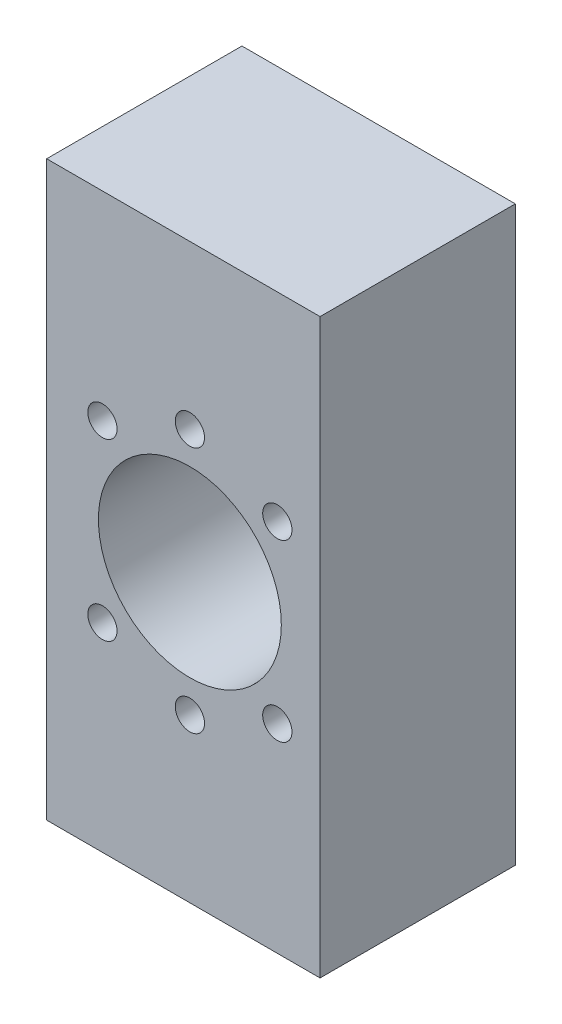
ISO-10303-21;
HEADER;
FILE_DESCRIPTION(('STEP AP214'),'2;1');
FILE_NAME('part.step','',(''),(''),'','','');
FILE_SCHEMA(('AUTOMOTIVE_DESIGN { 1 0 10303 214 1 1 1 1 }'));
ENDSEC;
DATA;
#1=APPLICATION_CONTEXT('core data for automotive mechanical design processes');
#2=APPLICATION_PROTOCOL_DEFINITION('international standard','automotive_design',2000,#1);
#3=PRODUCT_CONTEXT('',#1,'mechanical');
#4=PRODUCT('Part','Part','',(#3));
#5=PRODUCT_RELATED_PRODUCT_CATEGORY('part','',(#4));
#6=PRODUCT_DEFINITION_FORMATION('','',#4);
#7=PRODUCT_DEFINITION_CONTEXT('part definition',#1,'design');
#8=PRODUCT_DEFINITION('design','',#6,#7);
#9=PRODUCT_DEFINITION_SHAPE('','',#8);
#10=(LENGTH_UNIT() NAMED_UNIT(*) SI_UNIT(.MILLI.,.METRE.));
#11=(NAMED_UNIT(*) PLANE_ANGLE_UNIT() SI_UNIT($,.RADIAN.));
#12=(NAMED_UNIT(*) SI_UNIT($,.STERADIAN.) SOLID_ANGLE_UNIT());
#13=UNCERTAINTY_MEASURE_WITH_UNIT(LENGTH_MEASURE(1.E-05),#10,'distance_accuracy_value','');
#14=(GEOMETRIC_REPRESENTATION_CONTEXT(3) GLOBAL_UNCERTAINTY_ASSIGNED_CONTEXT((#13)) GLOBAL_UNIT_ASSIGNED_CONTEXT((#10,
#11,#12)) REPRESENTATION_CONTEXT('',''));
#15=CARTESIAN_POINT('',(0.,0.,0.));
#16=DIRECTION('',(0.,0.,1.));
#17=DIRECTION('',(1.,0.,0.));
#18=AXIS2_PLACEMENT_3D('',#15,#16,#17);
#19=CARTESIAN_POINT('',(-1.00000000000001,-44.,40.));
#20=DIRECTION('',(0.,1.,0.));
#21=DIRECTION('',(0.,0.,1.));
#22=AXIS2_PLACEMENT_3D('',#19,#20,#21);
#23=PLANE('',#22);
#24=DIRECTION('',(1.,0.,0.));
#25=VECTOR('',#24,1.);
#26=CARTESIAN_POINT('',(-1.00000000000001,-44.,10.));
#27=LINE('',#26,#25);
#28=CARTESIAN_POINT('',(-22.,-44.,10.));
#29=VERTEX_POINT('',#28);
#30=CARTESIAN_POINT('',(20.,-44.,10.));
#31=VERTEX_POINT('',#30);
#32=EDGE_CURVE('E79',#29,#31,#27,.T.);
#33=ORIENTED_EDGE('',*,*,#32,.T.);
#34=DIRECTION('',(0.,0.,-1.));
#35=VECTOR('',#34,1.);
#36=CARTESIAN_POINT('',(20.,-44.,40.));
#37=LINE('',#36,#35);
#38=CARTESIAN_POINT('',(20.,-44.,40.));
#39=VERTEX_POINT('',#38);
#40=EDGE_CURVE('E11',#39,#31,#37,.T.);
#41=ORIENTED_EDGE('',*,*,#40,.F.);
#42=DIRECTION('',(1.,0.,0.));
#43=VECTOR('',#42,1.);
#44=CARTESIAN_POINT('',(-1.00000000000001,-44.,40.));
#45=LINE('',#44,#43);
#46=CARTESIAN_POINT('',(-22.,-44.,40.));
#47=VERTEX_POINT('',#46);
#48=EDGE_CURVE('E115',#47,#39,#45,.T.);
#49=ORIENTED_EDGE('',*,*,#48,.F.);
#50=DIRECTION('',(0.,0.,-1.));
#51=VECTOR('',#50,1.);
#52=CARTESIAN_POINT('',(-22.,-44.,40.));
#53=LINE('',#52,#51);
#54=EDGE_CURVE('E80',#47,#29,#53,.T.);
#55=ORIENTED_EDGE('',*,*,#54,.T.);
#56=EDGE_LOOP('',(#33,#41,#49,#55));
#57=FACE_BOUND('',#56,.T.);
#58=ADVANCED_FACE('F29',(#57),#23,.F.);
#59=CARTESIAN_POINT('',(20.,-75.9856037303654,40.));
#60=DIRECTION('',(1.,0.,0.));
#61=DIRECTION('',(0.,1.,0.));
#62=AXIS2_PLACEMENT_3D('',#59,#60,#61);
#63=PLANE('',#62);
#64=DIRECTION('',(0.,-1.,0.));
#65=VECTOR('',#64,1.);
#66=CARTESIAN_POINT('',(20.,-75.9856037303654,10.));
#67=LINE('',#66,#65);
#68=CARTESIAN_POINT('',(20.,44.,10.));
#69=VERTEX_POINT('',#68);
#70=EDGE_CURVE('E73',#69,#31,#67,.T.);
#71=ORIENTED_EDGE('',*,*,#70,.F.);
#72=DIRECTION('',(0.,0.,-1.));
#73=VECTOR('',#72,1.);
#74=CARTESIAN_POINT('',(20.,44.,40.));
#75=LINE('',#74,#73);
#76=CARTESIAN_POINT('',(20.,44.,40.));
#77=VERTEX_POINT('',#76);
#78=EDGE_CURVE('E37',#77,#69,#75,.T.);
#79=ORIENTED_EDGE('',*,*,#78,.F.);
#80=DIRECTION('',(0.,-1.,0.));
#81=VECTOR('',#80,1.);
#82=CARTESIAN_POINT('',(20.,-75.9856037303654,40.));
#83=LINE('',#82,#81);
#84=EDGE_CURVE('E74',#77,#39,#83,.T.);
#85=ORIENTED_EDGE('',*,*,#84,.T.);
#86=ORIENTED_EDGE('',*,*,#40,.T.);
#87=EDGE_LOOP('',(#71,#79,#85,#86));
#88=FACE_BOUND('',#87,.T.);
#89=ADVANCED_FACE('F71',(#88),#63,.T.);
#90=CARTESIAN_POINT('',(-1.00000000000001,44.,40.));
#91=DIRECTION('',(0.,-1.,0.));
#92=DIRECTION('',(0.,0.,-1.));
#93=AXIS2_PLACEMENT_3D('',#90,#91,#92);
#94=PLANE('',#93);
#95=DIRECTION('',(-1.,0.,0.));
#96=VECTOR('',#95,1.);
#97=CARTESIAN_POINT('',(-1.00000000000001,44.,10.));
#98=LINE('',#97,#96);
#99=CARTESIAN_POINT('',(-22.,44.,10.));
#100=VERTEX_POINT('',#99);
#101=EDGE_CURVE('E87',#69,#100,#98,.T.);
#102=ORIENTED_EDGE('',*,*,#101,.T.);
#103=DIRECTION('',(0.,0.,-1.));
#104=VECTOR('',#103,1.);
#105=CARTESIAN_POINT('',(-22.,44.,40.));
#106=LINE('',#105,#104);
#107=CARTESIAN_POINT('',(-22.,44.,40.));
#108=VERTEX_POINT('',#107);
#109=EDGE_CURVE('E121',#108,#100,#106,.T.);
#110=ORIENTED_EDGE('',*,*,#109,.F.);
#111=DIRECTION('',(-1.,0.,0.));
#112=VECTOR('',#111,1.);
#113=CARTESIAN_POINT('',(-1.00000000000001,44.,40.));
#114=LINE('',#113,#112);
#115=EDGE_CURVE('E49',#77,#108,#114,.T.);
#116=ORIENTED_EDGE('',*,*,#115,.F.);
#117=ORIENTED_EDGE('',*,*,#78,.T.);
#118=EDGE_LOOP('',(#102,#110,#116,#117));
#119=FACE_BOUND('',#118,.T.);
#120=ADVANCED_FACE('F124',(#119),#94,.F.);
#121=CARTESIAN_POINT('',(0.,0.,40.));
#122=DIRECTION('',(0.,0.,-1.));
#123=DIRECTION('',(-1.,0.,0.));
#124=AXIS2_PLACEMENT_3D('',#121,#122,#123);
#125=CYLINDRICAL_SURFACE('',#124,14.05);
#126=CARTESIAN_POINT('',(0.,0.,40.));
#127=DIRECTION('',(0.,0.,1.));
#128=DIRECTION('',(1.,0.,0.));
#129=AXIS2_PLACEMENT_3D('',#126,#127,#128);
#130=CIRCLE('',#129,14.05);
#131=CARTESIAN_POINT('',(14.05,0.,40.));
#132=VERTEX_POINT('',#131);
#133=EDGE_CURVE('E112',#132,#132,#130,.T.);
#134=ORIENTED_EDGE('',*,*,#133,.T.);
#135=EDGE_LOOP('',(#134));
#136=FACE_BOUND('',#135,.T.);
#137=CARTESIAN_POINT('',(0.,0.,10.));
#138=DIRECTION('',(0.,0.,1.));
#139=DIRECTION('',(1.,0.,0.));
#140=AXIS2_PLACEMENT_3D('',#137,#138,#139);
#141=CIRCLE('',#140,14.05);
#142=CARTESIAN_POINT('',(14.05,0.,10.));
#143=VERTEX_POINT('',#142);
#144=EDGE_CURVE('E83',#143,#143,#141,.T.);
#145=ORIENTED_EDGE('',*,*,#144,.F.);
#146=EDGE_LOOP('',(#145));
#147=FACE_BOUND('',#146,.T.);
#148=ADVANCED_FACE('F150',(#136,#147),#125,.F.);
#149=CARTESIAN_POINT('',(-13.4350288425445,13.4350288425444,40.));
#150=DIRECTION('',(0.,0.,-1.));
#151=DIRECTION('',(-1.,0.,0.));
#152=AXIS2_PLACEMENT_3D('',#149,#150,#151);
#153=CYLINDRICAL_SURFACE('',#152,2.25);
#154=CARTESIAN_POINT('',(-13.4350288425445,13.4350288425444,40.));
#155=DIRECTION('',(0.,0.,1.));
#156=DIRECTION('',(1.,0.,0.));
#157=AXIS2_PLACEMENT_3D('',#154,#155,#156);
#158=CIRCLE('',#157,2.25);
#159=CARTESIAN_POINT('',(-11.1850288425445,13.4350288425444,40.));
#160=VERTEX_POINT('',#159);
#161=EDGE_CURVE('E109',#160,#160,#158,.T.);
#162=ORIENTED_EDGE('',*,*,#161,.T.);
#163=EDGE_LOOP('',(#162));
#164=FACE_BOUND('',#163,.T.);
#165=CARTESIAN_POINT('',(-13.4350288425445,13.4350288425444,10.));
#166=DIRECTION('',(0.,0.,1.));
#167=DIRECTION('',(1.,0.,0.));
#168=AXIS2_PLACEMENT_3D('',#165,#166,#167);
#169=CIRCLE('',#168,2.25);
#170=CARTESIAN_POINT('',(-11.1850288425445,13.4350288425444,10.));
#171=VERTEX_POINT('',#170);
#172=EDGE_CURVE('E197',#171,#171,#169,.T.);
#173=ORIENTED_EDGE('',*,*,#172,.F.);
#174=EDGE_LOOP('',(#173));
#175=FACE_BOUND('',#174,.T.);
#176=ADVANCED_FACE('F153',(#164,#175),#153,.F.);
#177=CARTESIAN_POINT('',(0.,19.,40.));
#178=DIRECTION('',(0.,0.,-1.));
#179=DIRECTION('',(-1.,0.,0.));
#180=AXIS2_PLACEMENT_3D('',#177,#178,#179);
#181=CYLINDRICAL_SURFACE('',#180,2.25);
#182=CARTESIAN_POINT('',(0.,19.,40.));
#183=DIRECTION('',(0.,0.,1.));
#184=DIRECTION('',(1.,0.,0.));
#185=AXIS2_PLACEMENT_3D('',#182,#183,#184);
#186=CIRCLE('',#185,2.25);
#187=CARTESIAN_POINT('',(2.25,19.,40.));
#188=VERTEX_POINT('',#187);
#189=EDGE_CURVE('E106',#188,#188,#186,.T.);
#190=ORIENTED_EDGE('',*,*,#189,.T.);
#191=EDGE_LOOP('',(#190));
#192=FACE_BOUND('',#191,.T.);
#193=CARTESIAN_POINT('',(0.,19.,10.));
#194=DIRECTION('',(0.,0.,1.));
#195=DIRECTION('',(1.,0.,0.));
#196=AXIS2_PLACEMENT_3D('',#193,#194,#195);
#197=CIRCLE('',#196,2.25);
#198=CARTESIAN_POINT('',(2.25,19.,10.));
#199=VERTEX_POINT('',#198);
#200=EDGE_CURVE('E194',#199,#199,#197,.T.);
#201=ORIENTED_EDGE('',*,*,#200,.F.);
#202=EDGE_LOOP('',(#201));
#203=FACE_BOUND('',#202,.T.);
#204=ADVANCED_FACE('F157',(#192,#203),#181,.F.);
#205=CARTESIAN_POINT('',(13.4350288425444,13.4350288425444,40.));
#206=DIRECTION('',(0.,0.,-1.));
#207=DIRECTION('',(-1.,0.,0.));
#208=AXIS2_PLACEMENT_3D('',#205,#206,#207);
#209=CYLINDRICAL_SURFACE('',#208,2.25);
#210=CARTESIAN_POINT('',(13.4350288425444,13.4350288425444,40.));
#211=DIRECTION('',(0.,0.,1.));
#212=DIRECTION('',(1.,0.,0.));
#213=AXIS2_PLACEMENT_3D('',#210,#211,#212);
#214=CIRCLE('',#213,2.25);
#215=CARTESIAN_POINT('',(15.6850288425444,13.4350288425444,40.));
#216=VERTEX_POINT('',#215);
#217=EDGE_CURVE('E103',#216,#216,#214,.T.);
#218=ORIENTED_EDGE('',*,*,#217,.T.);
#219=EDGE_LOOP('',(#218));
#220=FACE_BOUND('',#219,.T.);
#221=CARTESIAN_POINT('',(13.4350288425444,13.4350288425444,10.));
#222=DIRECTION('',(0.,0.,1.));
#223=DIRECTION('',(1.,0.,0.));
#224=AXIS2_PLACEMENT_3D('',#221,#222,#223);
#225=CIRCLE('',#224,2.25);
#226=CARTESIAN_POINT('',(15.6850288425444,13.4350288425444,10.));
#227=VERTEX_POINT('',#226);
#228=EDGE_CURVE('E185',#227,#227,#225,.T.);
#229=ORIENTED_EDGE('',*,*,#228,.F.);
#230=EDGE_LOOP('',(#229));
#231=FACE_BOUND('',#230,.T.);
#232=ADVANCED_FACE('F161',(#220,#231),#209,.F.);
#233=CARTESIAN_POINT('',(13.4350288425444,-13.4350288425444,40.));
#234=DIRECTION('',(0.,0.,-1.));
#235=DIRECTION('',(-1.,0.,0.));
#236=AXIS2_PLACEMENT_3D('',#233,#234,#235);
#237=CYLINDRICAL_SURFACE('',#236,2.25);
#238=CARTESIAN_POINT('',(13.4350288425444,-13.4350288425444,40.));
#239=DIRECTION('',(0.,0.,1.));
#240=DIRECTION('',(1.,0.,0.));
#241=AXIS2_PLACEMENT_3D('',#238,#239,#240);
#242=CIRCLE('',#241,2.25);
#243=CARTESIAN_POINT('',(15.6850288425444,-13.4350288425444,40.));
#244=VERTEX_POINT('',#243);
#245=EDGE_CURVE('E100',#244,#244,#242,.T.);
#246=ORIENTED_EDGE('',*,*,#245,.T.);
#247=EDGE_LOOP('',(#246));
#248=FACE_BOUND('',#247,.T.);
#249=CARTESIAN_POINT('',(13.4350288425444,-13.4350288425444,10.));
#250=DIRECTION('',(0.,0.,1.));
#251=DIRECTION('',(1.,0.,0.));
#252=AXIS2_PLACEMENT_3D('',#249,#250,#251);
#253=CIRCLE('',#252,2.25);
#254=CARTESIAN_POINT('',(15.6850288425444,-13.4350288425444,10.));
#255=VERTEX_POINT('',#254);
#256=EDGE_CURVE('E181',#255,#255,#253,.T.);
#257=ORIENTED_EDGE('',*,*,#256,.F.);
#258=EDGE_LOOP('',(#257));
#259=FACE_BOUND('',#258,.T.);
#260=ADVANCED_FACE('F165',(#248,#259),#237,.F.);
#261=CARTESIAN_POINT('',(0.,-19.,40.));
#262=DIRECTION('',(0.,0.,-1.));
#263=DIRECTION('',(-1.,0.,0.));
#264=AXIS2_PLACEMENT_3D('',#261,#262,#263);
#265=CYLINDRICAL_SURFACE('',#264,2.25);
#266=CARTESIAN_POINT('',(0.,-19.,40.));
#267=DIRECTION('',(0.,0.,1.));
#268=DIRECTION('',(1.,0.,0.));
#269=AXIS2_PLACEMENT_3D('',#266,#267,#268);
#270=CIRCLE('',#269,2.25);
#271=CARTESIAN_POINT('',(2.25,-19.,40.));
#272=VERTEX_POINT('',#271);
#273=EDGE_CURVE('E97',#272,#272,#270,.T.);
#274=ORIENTED_EDGE('',*,*,#273,.T.);
#275=EDGE_LOOP('',(#274));
#276=FACE_BOUND('',#275,.T.);
#277=CARTESIAN_POINT('',(0.,-19.,10.));
#278=DIRECTION('',(0.,0.,1.));
#279=DIRECTION('',(1.,0.,0.));
#280=AXIS2_PLACEMENT_3D('',#277,#278,#279);
#281=CIRCLE('',#280,2.25);
#282=CARTESIAN_POINT('',(2.25,-19.,10.));
#283=VERTEX_POINT('',#282);
#284=EDGE_CURVE('E179',#283,#283,#281,.T.);
#285=ORIENTED_EDGE('',*,*,#284,.F.);
#286=EDGE_LOOP('',(#285));
#287=FACE_BOUND('',#286,.T.);
#288=ADVANCED_FACE('F168',(#276,#287),#265,.F.);
#289=CARTESIAN_POINT('',(-13.4350288425444,-13.4350288425444,40.));
#290=DIRECTION('',(0.,0.,-1.));
#291=DIRECTION('',(-1.,0.,0.));
#292=AXIS2_PLACEMENT_3D('',#289,#290,#291);
#293=CYLINDRICAL_SURFACE('',#292,2.25);
#294=CARTESIAN_POINT('',(-13.4350288425444,-13.4350288425444,40.));
#295=DIRECTION('',(0.,0.,1.));
#296=DIRECTION('',(1.,0.,0.));
#297=AXIS2_PLACEMENT_3D('',#294,#295,#296);
#298=CIRCLE('',#297,2.25);
#299=CARTESIAN_POINT('',(-11.1850288425444,-13.4350288425444,40.));
#300=VERTEX_POINT('',#299);
#301=EDGE_CURVE('E94',#300,#300,#298,.T.);
#302=ORIENTED_EDGE('',*,*,#301,.T.);
#303=EDGE_LOOP('',(#302));
#304=FACE_BOUND('',#303,.T.);
#305=CARTESIAN_POINT('',(-13.4350288425444,-13.4350288425444,10.));
#306=DIRECTION('',(0.,0.,1.));
#307=DIRECTION('',(1.,0.,0.));
#308=AXIS2_PLACEMENT_3D('',#305,#306,#307);
#309=CIRCLE('',#308,2.25);
#310=CARTESIAN_POINT('',(-11.1850288425444,-13.4350288425444,10.));
#311=VERTEX_POINT('',#310);
#312=EDGE_CURVE('E182',#311,#311,#309,.T.);
#313=ORIENTED_EDGE('',*,*,#312,.F.);
#314=EDGE_LOOP('',(#313));
#315=FACE_BOUND('',#314,.T.);
#316=ADVANCED_FACE('F31',(#304,#315),#293,.F.);
#317=CARTESIAN_POINT('',(-22.,-75.9856037303654,40.));
#318=DIRECTION('',(1.,0.,0.));
#319=DIRECTION('',(0.,0.,-1.));
#320=AXIS2_PLACEMENT_3D('',#317,#318,#319);
#321=PLANE('',#320);
#322=CARTESIAN_POINT('',(-22.,-29.,32.5));
#323=DIRECTION('',(-1.,0.,0.));
#324=DIRECTION('',(0.,0.,1.));
#325=AXIS2_PLACEMENT_3D('',#322,#323,#324);
#326=CIRCLE('',#325,2.25);
#327=CARTESIAN_POINT('',(-22.,-29.,34.75));
#328=VERTEX_POINT('',#327);
#329=EDGE_CURVE('E256',#328,#328,#326,.T.);
#330=ORIENTED_EDGE('',*,*,#329,.F.);
#331=EDGE_LOOP('',(#330));
#332=FACE_BOUND('',#331,.T.);
#333=CARTESIAN_POINT('',(-22.,-29.,17.5));
#334=DIRECTION('',(-1.,0.,0.));
#335=DIRECTION('',(0.,0.,1.));
#336=AXIS2_PLACEMENT_3D('',#333,#334,#335);
#337=CIRCLE('',#336,2.25);
#338=CARTESIAN_POINT('',(-22.,-29.,19.75));
#339=VERTEX_POINT('',#338);
#340=EDGE_CURVE('E250',#339,#339,#337,.T.);
#341=ORIENTED_EDGE('',*,*,#340,.F.);
#342=EDGE_LOOP('',(#341));
#343=FACE_BOUND('',#342,.T.);
#344=CARTESIAN_POINT('',(-22.,29.,32.5));
#345=DIRECTION('',(-1.,0.,0.));
#346=DIRECTION('',(0.,0.,1.));
#347=AXIS2_PLACEMENT_3D('',#344,#345,#346);
#348=CIRCLE('',#347,2.25);
#349=CARTESIAN_POINT('',(-22.,29.,34.75));
#350=VERTEX_POINT('',#349);
#351=EDGE_CURVE('E244',#350,#350,#348,.T.);
#352=ORIENTED_EDGE('',*,*,#351,.F.);
#353=EDGE_LOOP('',(#352));
#354=FACE_BOUND('',#353,.T.);
#355=CARTESIAN_POINT('',(-22.,29.,17.5));
#356=DIRECTION('',(-1.,0.,0.));
#357=DIRECTION('',(0.,0.,1.));
#358=AXIS2_PLACEMENT_3D('',#355,#356,#357);
#359=CIRCLE('',#358,2.25);
#360=CARTESIAN_POINT('',(-22.,29.,19.75));
#361=VERTEX_POINT('',#360);
#362=EDGE_CURVE('E238',#361,#361,#359,.T.);
#363=ORIENTED_EDGE('',*,*,#362,.F.);
#364=EDGE_LOOP('',(#363));
#365=FACE_BOUND('',#364,.T.);
#366=CARTESIAN_POINT('',(-22.,-39.,32.5));
#367=DIRECTION('',(-1.,0.,0.));
#368=DIRECTION('',(0.,0.,1.));
#369=AXIS2_PLACEMENT_3D('',#366,#367,#368);
#370=CIRCLE('',#369,2.25);
#371=CARTESIAN_POINT('',(-22.,-39.,34.75));
#372=VERTEX_POINT('',#371);
#373=EDGE_CURVE('E232',#372,#372,#370,.T.);
#374=ORIENTED_EDGE('',*,*,#373,.F.);
#375=EDGE_LOOP('',(#374));
#376=FACE_BOUND('',#375,.T.);
#377=CARTESIAN_POINT('',(-22.,-39.,17.5));
#378=DIRECTION('',(-1.,0.,0.));
#379=DIRECTION('',(0.,0.,1.));
#380=AXIS2_PLACEMENT_3D('',#377,#378,#379);
#381=CIRCLE('',#380,2.25);
#382=CARTESIAN_POINT('',(-22.,-39.,19.75));
#383=VERTEX_POINT('',#382);
#384=EDGE_CURVE('E226',#383,#383,#381,.T.);
#385=ORIENTED_EDGE('',*,*,#384,.F.);
#386=EDGE_LOOP('',(#385));
#387=FACE_BOUND('',#386,.T.);
#388=CARTESIAN_POINT('',(-22.,39.,32.5));
#389=DIRECTION('',(-1.,0.,0.));
#390=DIRECTION('',(0.,0.,1.));
#391=AXIS2_PLACEMENT_3D('',#388,#389,#390);
#392=CIRCLE('',#391,2.25);
#393=CARTESIAN_POINT('',(-22.,39.,34.75));
#394=VERTEX_POINT('',#393);
#395=EDGE_CURVE('E220',#394,#394,#392,.T.);
#396=ORIENTED_EDGE('',*,*,#395,.F.);
#397=EDGE_LOOP('',(#396));
#398=FACE_BOUND('',#397,.T.);
#399=CARTESIAN_POINT('',(-22.,39.,17.5));
#400=DIRECTION('',(-1.,0.,0.));
#401=DIRECTION('',(0.,0.,1.));
#402=AXIS2_PLACEMENT_3D('',#399,#400,#401);
#403=CIRCLE('',#402,2.25);
#404=CARTESIAN_POINT('',(-22.,39.,19.75));
#405=VERTEX_POINT('',#404);
#406=EDGE_CURVE('E214',#405,#405,#403,.T.);
#407=ORIENTED_EDGE('',*,*,#406,.F.);
#408=EDGE_LOOP('',(#407));
#409=FACE_BOUND('',#408,.T.);
#410=DIRECTION('',(0.,-1.,0.));
#411=VECTOR('',#410,1.);
#412=CARTESIAN_POINT('',(-22.,-75.9856037303654,10.));
#413=LINE('',#412,#411);
#414=EDGE_CURVE('E89',#100,#29,#413,.T.);
#415=ORIENTED_EDGE('',*,*,#414,.T.);
#416=ORIENTED_EDGE('',*,*,#54,.F.);
#417=DIRECTION('',(0.,-1.,0.));
#418=VECTOR('',#417,1.);
#419=CARTESIAN_POINT('',(-22.,-75.9856037303654,40.));
#420=LINE('',#419,#418);
#421=EDGE_CURVE('E44',#108,#47,#420,.T.);
#422=ORIENTED_EDGE('',*,*,#421,.F.);
#423=ORIENTED_EDGE('',*,*,#109,.T.);
#424=EDGE_LOOP('',(#415,#416,#422,#423));
#425=FACE_BOUND('',#424,.T.);
#426=ADVANCED_FACE('F127',(#332,#343,#354,#365,#376,#387,#398,#409,#425),#321,.F.);
#427=CARTESIAN_POINT('',(-1.00000000000001,-75.9856037303654,40.));
#428=DIRECTION('',(0.,0.,1.));
#429=DIRECTION('',(1.,0.,0.));
#430=AXIS2_PLACEMENT_3D('',#427,#428,#429);
#431=PLANE('',#430);
#432=ORIENTED_EDGE('',*,*,#301,.F.);
#433=EDGE_LOOP('',(#432));
#434=FACE_BOUND('',#433,.T.);
#435=ORIENTED_EDGE('',*,*,#273,.F.);
#436=EDGE_LOOP('',(#435));
#437=FACE_BOUND('',#436,.T.);
#438=ORIENTED_EDGE('',*,*,#245,.F.);
#439=EDGE_LOOP('',(#438));
#440=FACE_BOUND('',#439,.T.);
#441=ORIENTED_EDGE('',*,*,#217,.F.);
#442=EDGE_LOOP('',(#441));
#443=FACE_BOUND('',#442,.T.);
#444=ORIENTED_EDGE('',*,*,#189,.F.);
#445=EDGE_LOOP('',(#444));
#446=FACE_BOUND('',#445,.T.);
#447=ORIENTED_EDGE('',*,*,#161,.F.);
#448=EDGE_LOOP('',(#447));
#449=FACE_BOUND('',#448,.T.);
#450=ORIENTED_EDGE('',*,*,#133,.F.);
#451=EDGE_LOOP('',(#450));
#452=FACE_BOUND('',#451,.T.);
#453=ORIENTED_EDGE('',*,*,#48,.T.);
#454=ORIENTED_EDGE('',*,*,#84,.F.);
#455=ORIENTED_EDGE('',*,*,#115,.T.);
#456=ORIENTED_EDGE('',*,*,#421,.T.);
#457=EDGE_LOOP('',(#453,#454,#455,#456));
#458=FACE_BOUND('',#457,.T.);
#459=ADVANCED_FACE('F125',(#434,#437,#440,#443,#446,#449,#452,#458),#431,.T.);
#460=CARTESIAN_POINT('',(-1.00000000000001,-75.9856037303654,10.));
#461=DIRECTION('',(0.,0.,1.));
#462=DIRECTION('',(1.,0.,0.));
#463=AXIS2_PLACEMENT_3D('',#460,#461,#462);
#464=PLANE('',#463);
#465=ORIENTED_EDGE('',*,*,#312,.T.);
#466=EDGE_LOOP('',(#465));
#467=FACE_BOUND('',#466,.T.);
#468=ORIENTED_EDGE('',*,*,#284,.T.);
#469=EDGE_LOOP('',(#468));
#470=FACE_BOUND('',#469,.T.);
#471=ORIENTED_EDGE('',*,*,#256,.T.);
#472=EDGE_LOOP('',(#471));
#473=FACE_BOUND('',#472,.T.);
#474=ORIENTED_EDGE('',*,*,#228,.T.);
#475=EDGE_LOOP('',(#474));
#476=FACE_BOUND('',#475,.T.);
#477=ORIENTED_EDGE('',*,*,#200,.T.);
#478=EDGE_LOOP('',(#477));
#479=FACE_BOUND('',#478,.T.);
#480=ORIENTED_EDGE('',*,*,#172,.T.);
#481=EDGE_LOOP('',(#480));
#482=FACE_BOUND('',#481,.T.);
#483=ORIENTED_EDGE('',*,*,#144,.T.);
#484=EDGE_LOOP('',(#483));
#485=FACE_BOUND('',#484,.T.);
#486=ORIENTED_EDGE('',*,*,#32,.F.);
#487=ORIENTED_EDGE('',*,*,#414,.F.);
#488=ORIENTED_EDGE('',*,*,#101,.F.);
#489=ORIENTED_EDGE('',*,*,#70,.T.);
#490=EDGE_LOOP('',(#486,#487,#488,#489));
#491=FACE_BOUND('',#490,.T.);
#492=ADVANCED_FACE('F86',(#467,#470,#473,#476,#479,#482,#485,#491),#464,.F.);
#493=CARTESIAN_POINT('',(7.99999999999999,39.,17.5));
#494=DIRECTION('',(-1.,0.,0.));
#495=DIRECTION('',(0.,0.,1.));
#496=AXIS2_PLACEMENT_3D('',#493,#494,#495);
#497=CYLINDRICAL_SURFACE('',#496,2.25);
#498=CARTESIAN_POINT('',(7.99999999999999,39.,17.5));
#499=DIRECTION('',(-1.,0.,0.));
#500=DIRECTION('',(0.,0.,1.));
#501=AXIS2_PLACEMENT_3D('',#498,#499,#500);
#502=CIRCLE('',#501,2.25);
#503=CARTESIAN_POINT('',(7.99999999999999,39.,19.75));
#504=VERTEX_POINT('',#503);
#505=EDGE_CURVE('E188',#504,#504,#502,.T.);
#506=ORIENTED_EDGE('',*,*,#505,.F.);
#507=EDGE_LOOP('',(#506));
#508=FACE_BOUND('',#507,.T.);
#509=ORIENTED_EDGE('',*,*,#406,.T.);
#510=EDGE_LOOP('',(#509));
#511=FACE_BOUND('',#510,.T.);
#512=ADVANCED_FACE('F134',(#508,#511),#497,.F.);
#513=CARTESIAN_POINT('',(7.99999999999999,39.,17.5));
#514=DIRECTION('',(-1.,0.,0.));
#515=DIRECTION('',(0.,0.,1.));
#516=AXIS2_PLACEMENT_3D('',#513,#514,#515);
#517=PLANE('',#516);
#518=ORIENTED_EDGE('',*,*,#505,.T.);
#519=EDGE_LOOP('',(#518));
#520=FACE_BOUND('',#519,.T.);
#521=ADVANCED_FACE('F278',(#520),#517,.T.);
#522=CARTESIAN_POINT('',(7.99999999999999,39.,32.5));
#523=DIRECTION('',(-1.,0.,0.));
#524=DIRECTION('',(0.,0.,1.));
#525=AXIS2_PLACEMENT_3D('',#522,#523,#524);
#526=CYLINDRICAL_SURFACE('',#525,2.25);
#527=CARTESIAN_POINT('',(7.99999999999999,39.,32.5));
#528=DIRECTION('',(-1.,0.,0.));
#529=DIRECTION('',(0.,0.,1.));
#530=AXIS2_PLACEMENT_3D('',#527,#528,#529);
#531=CIRCLE('',#530,2.25);
#532=CARTESIAN_POINT('',(7.99999999999999,39.,34.75));
#533=VERTEX_POINT('',#532);
#534=EDGE_CURVE('E217',#533,#533,#531,.T.);
#535=ORIENTED_EDGE('',*,*,#534,.F.);
#536=EDGE_LOOP('',(#535));
#537=FACE_BOUND('',#536,.T.);
#538=ORIENTED_EDGE('',*,*,#395,.T.);
#539=EDGE_LOOP('',(#538));
#540=FACE_BOUND('',#539,.T.);
#541=ADVANCED_FACE('F284',(#537,#540),#526,.F.);
#542=CARTESIAN_POINT('',(7.99999999999999,39.,32.5));
#543=DIRECTION('',(-1.,0.,0.));
#544=DIRECTION('',(0.,0.,1.));
#545=AXIS2_PLACEMENT_3D('',#542,#543,#544);
#546=PLANE('',#545);
#547=ORIENTED_EDGE('',*,*,#534,.T.);
#548=EDGE_LOOP('',(#547));
#549=FACE_BOUND('',#548,.T.);
#550=ADVANCED_FACE('F291',(#549),#546,.T.);
#551=CARTESIAN_POINT('',(7.99999999999999,-39.,17.5));
#552=DIRECTION('',(-1.,0.,0.));
#553=DIRECTION('',(0.,0.,1.));
#554=AXIS2_PLACEMENT_3D('',#551,#552,#553);
#555=CYLINDRICAL_SURFACE('',#554,2.25);
#556=CARTESIAN_POINT('',(7.99999999999999,-39.,17.5));
#557=DIRECTION('',(-1.,0.,0.));
#558=DIRECTION('',(0.,0.,1.));
#559=AXIS2_PLACEMENT_3D('',#556,#557,#558);
#560=CIRCLE('',#559,2.25);
#561=CARTESIAN_POINT('',(7.99999999999999,-39.,19.75));
#562=VERTEX_POINT('',#561);
#563=EDGE_CURVE('E223',#562,#562,#560,.T.);
#564=ORIENTED_EDGE('',*,*,#563,.F.);
#565=EDGE_LOOP('',(#564));
#566=FACE_BOUND('',#565,.T.);
#567=ORIENTED_EDGE('',*,*,#384,.T.);
#568=EDGE_LOOP('',(#567));
#569=FACE_BOUND('',#568,.T.);
#570=ADVANCED_FACE('F295',(#566,#569),#555,.F.);
#571=CARTESIAN_POINT('',(7.99999999999999,-39.,17.5));
#572=DIRECTION('',(-1.,0.,0.));
#573=DIRECTION('',(0.,0.,1.));
#574=AXIS2_PLACEMENT_3D('',#571,#572,#573);
#575=PLANE('',#574);
#576=ORIENTED_EDGE('',*,*,#563,.T.);
#577=EDGE_LOOP('',(#576));
#578=FACE_BOUND('',#577,.T.);
#579=ADVANCED_FACE('F299',(#578),#575,.T.);
#580=CARTESIAN_POINT('',(7.99999999999999,-39.,32.5));
#581=DIRECTION('',(-1.,0.,0.));
#582=DIRECTION('',(0.,0.,1.));
#583=AXIS2_PLACEMENT_3D('',#580,#581,#582);
#584=CYLINDRICAL_SURFACE('',#583,2.25);
#585=CARTESIAN_POINT('',(7.99999999999999,-39.,32.5));
#586=DIRECTION('',(-1.,0.,0.));
#587=DIRECTION('',(0.,0.,1.));
#588=AXIS2_PLACEMENT_3D('',#585,#586,#587);
#589=CIRCLE('',#588,2.25);
#590=CARTESIAN_POINT('',(7.99999999999999,-39.,34.75));
#591=VERTEX_POINT('',#590);
#592=EDGE_CURVE('E229',#591,#591,#589,.T.);
#593=ORIENTED_EDGE('',*,*,#592,.F.);
#594=EDGE_LOOP('',(#593));
#595=FACE_BOUND('',#594,.T.);
#596=ORIENTED_EDGE('',*,*,#373,.T.);
#597=EDGE_LOOP('',(#596));
#598=FACE_BOUND('',#597,.T.);
#599=ADVANCED_FACE('F303',(#595,#598),#584,.F.);
#600=CARTESIAN_POINT('',(7.99999999999999,-39.,32.5));
#601=DIRECTION('',(-1.,0.,0.));
#602=DIRECTION('',(0.,0.,1.));
#603=AXIS2_PLACEMENT_3D('',#600,#601,#602);
#604=PLANE('',#603);
#605=ORIENTED_EDGE('',*,*,#592,.T.);
#606=EDGE_LOOP('',(#605));
#607=FACE_BOUND('',#606,.T.);
#608=ADVANCED_FACE('F307',(#607),#604,.T.);
#609=CARTESIAN_POINT('',(7.99999999999999,29.,17.5));
#610=DIRECTION('',(-1.,0.,0.));
#611=DIRECTION('',(0.,0.,1.));
#612=AXIS2_PLACEMENT_3D('',#609,#610,#611);
#613=CYLINDRICAL_SURFACE('',#612,2.25);
#614=CARTESIAN_POINT('',(7.99999999999999,29.,17.5));
#615=DIRECTION('',(-1.,0.,0.));
#616=DIRECTION('',(0.,0.,1.));
#617=AXIS2_PLACEMENT_3D('',#614,#615,#616);
#618=CIRCLE('',#617,2.25);
#619=CARTESIAN_POINT('',(7.99999999999999,29.,19.75));
#620=VERTEX_POINT('',#619);
#621=EDGE_CURVE('E235',#620,#620,#618,.T.);
#622=ORIENTED_EDGE('',*,*,#621,.F.);
#623=EDGE_LOOP('',(#622));
#624=FACE_BOUND('',#623,.T.);
#625=ORIENTED_EDGE('',*,*,#362,.T.);
#626=EDGE_LOOP('',(#625));
#627=FACE_BOUND('',#626,.T.);
#628=ADVANCED_FACE('F311',(#624,#627),#613,.F.);
#629=CARTESIAN_POINT('',(7.99999999999999,29.,17.5));
#630=DIRECTION('',(-1.,0.,0.));
#631=DIRECTION('',(0.,0.,1.));
#632=AXIS2_PLACEMENT_3D('',#629,#630,#631);
#633=PLANE('',#632);
#634=ORIENTED_EDGE('',*,*,#621,.T.);
#635=EDGE_LOOP('',(#634));
#636=FACE_BOUND('',#635,.T.);
#637=ADVANCED_FACE('F315',(#636),#633,.T.);
#638=CARTESIAN_POINT('',(7.99999999999999,29.,32.5));
#639=DIRECTION('',(-1.,0.,0.));
#640=DIRECTION('',(0.,0.,1.));
#641=AXIS2_PLACEMENT_3D('',#638,#639,#640);
#642=CYLINDRICAL_SURFACE('',#641,2.25);
#643=CARTESIAN_POINT('',(7.99999999999999,29.,32.5));
#644=DIRECTION('',(-1.,0.,0.));
#645=DIRECTION('',(0.,0.,1.));
#646=AXIS2_PLACEMENT_3D('',#643,#644,#645);
#647=CIRCLE('',#646,2.25);
#648=CARTESIAN_POINT('',(7.99999999999999,29.,34.75));
#649=VERTEX_POINT('',#648);
#650=EDGE_CURVE('E241',#649,#649,#647,.T.);
#651=ORIENTED_EDGE('',*,*,#650,.F.);
#652=EDGE_LOOP('',(#651));
#653=FACE_BOUND('',#652,.T.);
#654=ORIENTED_EDGE('',*,*,#351,.T.);
#655=EDGE_LOOP('',(#654));
#656=FACE_BOUND('',#655,.T.);
#657=ADVANCED_FACE('F319',(#653,#656),#642,.F.);
#658=CARTESIAN_POINT('',(7.99999999999999,29.,32.5));
#659=DIRECTION('',(-1.,0.,0.));
#660=DIRECTION('',(0.,0.,1.));
#661=AXIS2_PLACEMENT_3D('',#658,#659,#660);
#662=PLANE('',#661);
#663=ORIENTED_EDGE('',*,*,#650,.T.);
#664=EDGE_LOOP('',(#663));
#665=FACE_BOUND('',#664,.T.);
#666=ADVANCED_FACE('F323',(#665),#662,.T.);
#667=CARTESIAN_POINT('',(7.99999999999999,-29.,17.5));
#668=DIRECTION('',(-1.,0.,0.));
#669=DIRECTION('',(0.,0.,1.));
#670=AXIS2_PLACEMENT_3D('',#667,#668,#669);
#671=CYLINDRICAL_SURFACE('',#670,2.25);
#672=CARTESIAN_POINT('',(7.99999999999999,-29.,17.5));
#673=DIRECTION('',(-1.,0.,0.));
#674=DIRECTION('',(0.,0.,1.));
#675=AXIS2_PLACEMENT_3D('',#672,#673,#674);
#676=CIRCLE('',#675,2.25);
#677=CARTESIAN_POINT('',(7.99999999999999,-29.,19.75));
#678=VERTEX_POINT('',#677);
#679=EDGE_CURVE('E247',#678,#678,#676,.T.);
#680=ORIENTED_EDGE('',*,*,#679,.F.);
#681=EDGE_LOOP('',(#680));
#682=FACE_BOUND('',#681,.T.);
#683=ORIENTED_EDGE('',*,*,#340,.T.);
#684=EDGE_LOOP('',(#683));
#685=FACE_BOUND('',#684,.T.);
#686=ADVANCED_FACE('F327',(#682,#685),#671,.F.);
#687=CARTESIAN_POINT('',(7.99999999999999,-29.,17.5));
#688=DIRECTION('',(-1.,0.,0.));
#689=DIRECTION('',(0.,0.,1.));
#690=AXIS2_PLACEMENT_3D('',#687,#688,#689);
#691=PLANE('',#690);
#692=ORIENTED_EDGE('',*,*,#679,.T.);
#693=EDGE_LOOP('',(#692));
#694=FACE_BOUND('',#693,.T.);
#695=ADVANCED_FACE('F331',(#694),#691,.T.);
#696=CARTESIAN_POINT('',(7.99999999999999,-29.,32.5));
#697=DIRECTION('',(-1.,0.,0.));
#698=DIRECTION('',(0.,0.,1.));
#699=AXIS2_PLACEMENT_3D('',#696,#697,#698);
#700=CYLINDRICAL_SURFACE('',#699,2.25);
#701=CARTESIAN_POINT('',(7.99999999999999,-29.,32.5));
#702=DIRECTION('',(-1.,0.,0.));
#703=DIRECTION('',(0.,0.,1.));
#704=AXIS2_PLACEMENT_3D('',#701,#702,#703);
#705=CIRCLE('',#704,2.25);
#706=CARTESIAN_POINT('',(7.99999999999999,-29.,34.75));
#707=VERTEX_POINT('',#706);
#708=EDGE_CURVE('E253',#707,#707,#705,.T.);
#709=ORIENTED_EDGE('',*,*,#708,.F.);
#710=EDGE_LOOP('',(#709));
#711=FACE_BOUND('',#710,.T.);
#712=ORIENTED_EDGE('',*,*,#329,.T.);
#713=EDGE_LOOP('',(#712));
#714=FACE_BOUND('',#713,.T.);
#715=ADVANCED_FACE('F260',(#711,#714),#700,.F.);
#716=CARTESIAN_POINT('',(7.99999999999999,-29.,32.5));
#717=DIRECTION('',(-1.,0.,0.));
#718=DIRECTION('',(0.,0.,1.));
#719=AXIS2_PLACEMENT_3D('',#716,#717,#718);
#720=PLANE('',#719);
#721=ORIENTED_EDGE('',*,*,#708,.T.);
#722=EDGE_LOOP('',(#721));
#723=FACE_BOUND('',#722,.T.);
#724=ADVANCED_FACE('F338',(#723),#720,.T.);
#725=CLOSED_SHELL('',(#58,#89,#120,#148,#176,#204,#232,#260,#288,#316,#426,#459,#492,#512,#521,
#541,#550,#570,#579,#599,#608,#628,#637,#657,#666,#686,#695,#715,#724));
#726=MANIFOLD_SOLID_BREP('B2',#725);
#727=ADVANCED_BREP_SHAPE_REPRESENTATION('',(#18,#726),#14);
#728=SHAPE_DEFINITION_REPRESENTATION(#9,#727);
ENDSEC;
END-ISO-10303-21;
